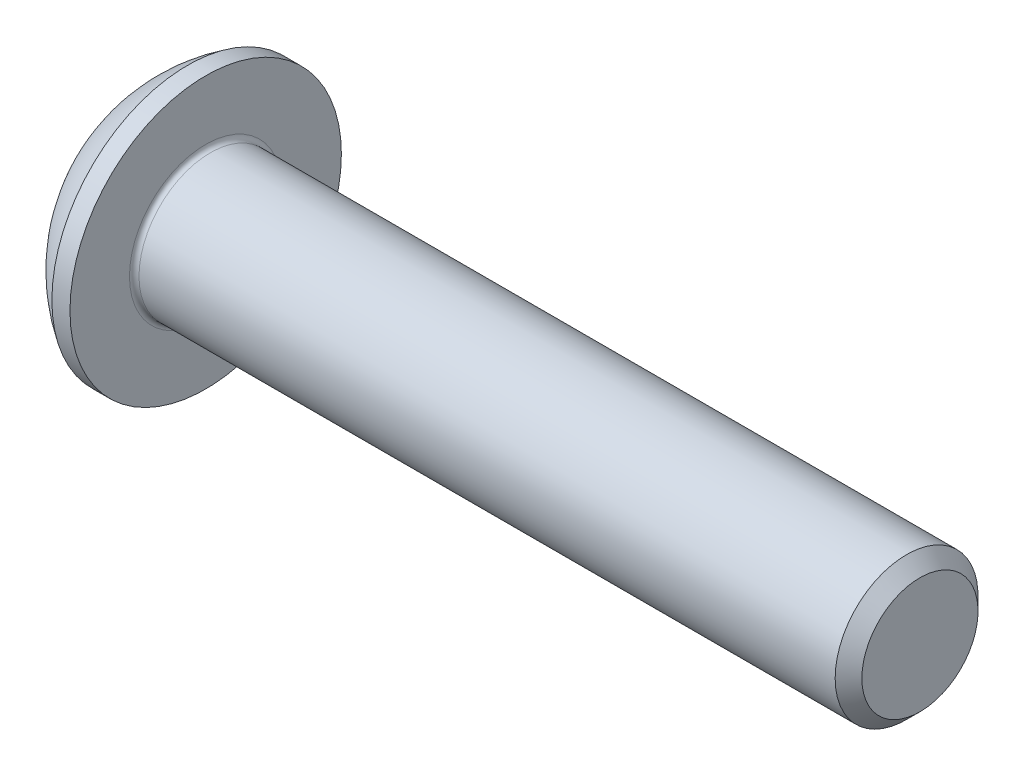
ISO-10303-21;
HEADER;
FILE_DESCRIPTION(('STEP AP214'),'2;1');
FILE_NAME('part.step','',(''),(''),'','','');
FILE_SCHEMA(('AUTOMOTIVE_DESIGN { 1 0 10303 214 1 1 1 1 }'));
ENDSEC;
DATA;
#1=APPLICATION_CONTEXT('core data for automotive mechanical design processes');
#2=APPLICATION_PROTOCOL_DEFINITION('international standard','automotive_design',2000,#1);
#3=PRODUCT_CONTEXT('',#1,'mechanical');
#4=PRODUCT('Part','Part','',(#3));
#5=PRODUCT_RELATED_PRODUCT_CATEGORY('part','',(#4));
#6=PRODUCT_DEFINITION_FORMATION('','',#4);
#7=PRODUCT_DEFINITION_CONTEXT('part definition',#1,'design');
#8=PRODUCT_DEFINITION('design','',#6,#7);
#9=PRODUCT_DEFINITION_SHAPE('','',#8);
#10=(LENGTH_UNIT() NAMED_UNIT(*) SI_UNIT(.MILLI.,.METRE.));
#11=(NAMED_UNIT(*) PLANE_ANGLE_UNIT() SI_UNIT($,.RADIAN.));
#12=(NAMED_UNIT(*) SI_UNIT($,.STERADIAN.) SOLID_ANGLE_UNIT());
#13=UNCERTAINTY_MEASURE_WITH_UNIT(LENGTH_MEASURE(1.E-05),#10,'distance_accuracy_value','');
#14=(GEOMETRIC_REPRESENTATION_CONTEXT(3) GLOBAL_UNCERTAINTY_ASSIGNED_CONTEXT((#13)) GLOBAL_UNIT_ASSIGNED_CONTEXT((#10,
#11,#12)) REPRESENTATION_CONTEXT('',''));
#15=CARTESIAN_POINT('',(0.,0.,0.));
#16=DIRECTION('',(0.,0.,1.));
#17=DIRECTION('',(1.,0.,0.));
#18=AXIS2_PLACEMENT_3D('',#15,#16,#17);
#19=CARTESIAN_POINT('',(0.,0.,0.));
#20=DIRECTION('',(-1.,0.,0.));
#21=DIRECTION('',(0.,0.,1.));
#22=AXIS2_PLACEMENT_3D('',#19,#20,#21);
#23=PLANE('',#22);
#24=CARTESIAN_POINT('',(0.,0.,0.));
#25=DIRECTION('',(-1.,0.,0.));
#26=DIRECTION('',(0.,0.,1.));
#27=AXIS2_PLACEMENT_3D('',#24,#25,#26);
#28=CIRCLE('',#27,1.425);
#29=CARTESIAN_POINT('',(0.,0.,1.425));
#30=VERTEX_POINT('',#29);
#31=EDGE_CURVE('E155',#30,#30,#28,.T.);
#32=ORIENTED_EDGE('',*,*,#31,.T.);
#33=EDGE_LOOP('',(#32));
#34=FACE_BOUND('',#33,.T.);
#35=DIRECTION('',(0.,-1.,0.));
#36=VECTOR('',#35,1.);
#37=CARTESIAN_POINT('',(0.,-0.577350269189625,0.999999999999998));
#38=LINE('',#37,#36);
#39=CARTESIAN_POINT('',(0.,0.577350269189628,1.));
#40=VERTEX_POINT('',#39);
#41=CARTESIAN_POINT('',(0.,-0.577350269189625,0.999999999999998));
#42=VERTEX_POINT('',#41);
#43=EDGE_CURVE('E50',#40,#42,#38,.T.);
#44=ORIENTED_EDGE('',*,*,#43,.T.);
#45=DIRECTION('',(0.,-0.499999999999999,-0.866025403784439));
#46=VECTOR('',#45,1.);
#47=CARTESIAN_POINT('',(0.,-1.15470053837925,0.));
#48=LINE('',#47,#46);
#49=CARTESIAN_POINT('',(0.,-1.15470053837925,0.));
#50=VERTEX_POINT('',#49);
#51=EDGE_CURVE('E275',#42,#50,#48,.T.);
#52=ORIENTED_EDGE('',*,*,#51,.T.);
#53=DIRECTION('',(0.,0.499999999999997,-0.86602540378444));
#54=VECTOR('',#53,1.);
#55=CARTESIAN_POINT('',(0.,-0.577350269189626,-1.));
#56=LINE('',#55,#54);
#57=CARTESIAN_POINT('',(0.,-0.577350269189626,-1.));
#58=VERTEX_POINT('',#57);
#59=EDGE_CURVE('E130',#50,#58,#56,.T.);
#60=ORIENTED_EDGE('',*,*,#59,.T.);
#61=DIRECTION('',(0.,1.,0.));
#62=VECTOR('',#61,1.);
#63=CARTESIAN_POINT('',(0.,0.577350269189628,-1.));
#64=LINE('',#63,#62);
#65=CARTESIAN_POINT('',(0.,0.577350269189628,-1.));
#66=VERTEX_POINT('',#65);
#67=EDGE_CURVE('E278',#58,#66,#64,.T.);
#68=ORIENTED_EDGE('',*,*,#67,.T.);
#69=DIRECTION('',(0.,0.499999999999998,0.866025403784439));
#70=VECTOR('',#69,1.);
#71=CARTESIAN_POINT('',(0.,1.15470053837925,0.));
#72=LINE('',#71,#70);
#73=CARTESIAN_POINT('',(0.,1.15470053837925,0.));
#74=VERTEX_POINT('',#73);
#75=EDGE_CURVE('E280',#66,#74,#72,.T.);
#76=ORIENTED_EDGE('',*,*,#75,.T.);
#77=DIRECTION('',(0.,-0.499999999999998,0.866025403784439));
#78=VECTOR('',#77,1.);
#79=CARTESIAN_POINT('',(0.,0.577350269189628,1.));
#80=LINE('',#79,#78);
#81=EDGE_CURVE('E282',#74,#40,#80,.T.);
#82=ORIENTED_EDGE('',*,*,#81,.T.);
#83=EDGE_LOOP('',(#44,#52,#60,#68,#76,#82));
#84=FACE_BOUND('',#83,.T.);
#85=ADVANCED_FACE('F35',(#34,#84),#23,.T.);
#86=CARTESIAN_POINT('',(3.03337598425198,0.,0.));
#87=DIRECTION('',(-1.,0.,0.));
#88=DIRECTION('',(0.,1.,0.));
#89=AXIS2_PLACEMENT_3D('',#86,#87,#88);
#90=SPHERICAL_SURFACE('',#89,3.35141684393879);
#91=CARTESIAN_POINT('',(1.27,0.,0.));
#92=DIRECTION('',(-1.,0.,0.));
#93=DIRECTION('',(0.,0.,1.));
#94=AXIS2_PLACEMENT_3D('',#91,#92,#93);
#95=CIRCLE('',#94,2.85);
#96=CARTESIAN_POINT('',(1.27,0.,2.85));
#97=VERTEX_POINT('',#96);
#98=EDGE_CURVE('E152',#97,#97,#95,.T.);
#99=ORIENTED_EDGE('',*,*,#98,.T.);
#100=EDGE_LOOP('',(#99));
#101=FACE_BOUND('',#100,.T.);
#102=ORIENTED_EDGE('',*,*,#31,.F.);
#103=EDGE_LOOP('',(#102));
#104=FACE_BOUND('',#103,.T.);
#105=ADVANCED_FACE('F176',(#101,#104),#90,.T.);
#106=CARTESIAN_POINT('',(0.,0.,0.));
#107=DIRECTION('',(-1.,0.,0.));
#108=DIRECTION('',(0.,0.,1.));
#109=AXIS2_PLACEMENT_3D('',#106,#107,#108);
#110=CYLINDRICAL_SURFACE('',#109,2.85);
#111=ORIENTED_EDGE('',*,*,#98,.F.);
#112=EDGE_LOOP('',(#111));
#113=FACE_BOUND('',#112,.T.);
#114=CARTESIAN_POINT('',(1.65,0.,0.));
#115=DIRECTION('',(-1.,0.,0.));
#116=DIRECTION('',(0.,0.,1.));
#117=AXIS2_PLACEMENT_3D('',#114,#115,#116);
#118=CIRCLE('',#117,2.85);
#119=CARTESIAN_POINT('',(1.65,0.,2.85));
#120=VERTEX_POINT('',#119);
#121=EDGE_CURVE('E149',#120,#120,#118,.T.);
#122=ORIENTED_EDGE('',*,*,#121,.T.);
#123=EDGE_LOOP('',(#122));
#124=FACE_BOUND('',#123,.T.);
#125=ADVANCED_FACE('F181',(#113,#124),#110,.T.);
#126=CARTESIAN_POINT('',(1.65,1.49999999999999,0.));
#127=DIRECTION('',(-1.,0.,0.));
#128=DIRECTION('',(0.,0.,1.));
#129=AXIS2_PLACEMENT_3D('',#126,#127,#128);
#130=PLANE('',#129);
#131=CARTESIAN_POINT('',(1.65,0.,0.));
#132=DIRECTION('',(-1.,0.,0.));
#133=DIRECTION('',(0.,0.,1.));
#134=AXIS2_PLACEMENT_3D('',#131,#132,#133);
#135=CIRCLE('',#134,1.6);
#136=CARTESIAN_POINT('',(1.65,0.,1.6));
#137=VERTEX_POINT('',#136);
#138=EDGE_CURVE('E43',#137,#137,#135,.T.);
#139=ORIENTED_EDGE('',*,*,#138,.T.);
#140=EDGE_LOOP('',(#139));
#141=FACE_BOUND('',#140,.T.);
#142=ORIENTED_EDGE('',*,*,#121,.F.);
#143=EDGE_LOOP('',(#142));
#144=FACE_BOUND('',#143,.T.);
#145=ADVANCED_FACE('F160',(#141,#144),#130,.F.);
#146=CARTESIAN_POINT('',(0.,0.,0.));
#147=DIRECTION('',(-1.,0.,0.));
#148=DIRECTION('',(0.,0.,1.));
#149=AXIS2_PLACEMENT_3D('',#146,#147,#148);
#150=CYLINDRICAL_SURFACE('',#149,1.5);
#151=CARTESIAN_POINT('',(1.75,0.,0.));
#152=DIRECTION('',(-1.,0.,0.));
#153=DIRECTION('',(0.,0.,1.));
#154=AXIS2_PLACEMENT_3D('',#151,#152,#153);
#155=CIRCLE('',#154,1.5);
#156=CARTESIAN_POINT('',(1.75,0.,1.5));
#157=VERTEX_POINT('',#156);
#158=EDGE_CURVE('E11',#157,#157,#155,.F.);
#159=ORIENTED_EDGE('',*,*,#158,.T.);
#160=EDGE_LOOP('',(#159));
#161=FACE_BOUND('',#160,.T.);
#162=CARTESIAN_POINT('',(16.3695,0.,0.));
#163=DIRECTION('',(-1.,0.,0.));
#164=DIRECTION('',(0.,0.,1.));
#165=AXIS2_PLACEMENT_3D('',#162,#163,#164);
#166=CIRCLE('',#165,1.5);
#167=CARTESIAN_POINT('',(16.3695,0.,1.5));
#168=VERTEX_POINT('',#167);
#169=EDGE_CURVE('E146',#168,#168,#166,.T.);
#170=ORIENTED_EDGE('',*,*,#169,.T.);
#171=EDGE_LOOP('',(#170));
#172=FACE_BOUND('',#171,.T.);
#173=ADVANCED_FACE('F190',(#161,#172),#150,.T.);
#174=CARTESIAN_POINT('',(16.65,0.,0.));
#175=DIRECTION('',(-1.,0.,0.));
#176=DIRECTION('',(0.,0.,1.));
#177=AXIS2_PLACEMENT_3D('',#174,#175,#176);
#178=CONICAL_SURFACE('',#177,1.2195,0.785398163397454);
#179=ORIENTED_EDGE('',*,*,#169,.F.);
#180=EDGE_LOOP('',(#179));
#181=FACE_BOUND('',#180,.T.);
#182=CARTESIAN_POINT('',(16.65,0.,0.));
#183=DIRECTION('',(-1.,0.,0.));
#184=DIRECTION('',(0.,0.,1.));
#185=AXIS2_PLACEMENT_3D('',#182,#183,#184);
#186=CIRCLE('',#185,1.2195);
#187=CARTESIAN_POINT('',(16.65,0.,1.2195));
#188=VERTEX_POINT('',#187);
#189=EDGE_CURVE('E142',#188,#188,#186,.T.);
#190=ORIENTED_EDGE('',*,*,#189,.T.);
#191=EDGE_LOOP('',(#190));
#192=FACE_BOUND('',#191,.T.);
#193=ADVANCED_FACE('F171',(#181,#192),#178,.T.);
#194=CARTESIAN_POINT('',(16.65,0.,0.));
#195=DIRECTION('',(-1.,0.,0.));
#196=DIRECTION('',(0.,0.,1.));
#197=AXIS2_PLACEMENT_3D('',#194,#195,#196);
#198=PLANE('',#197);
#199=ORIENTED_EDGE('',*,*,#189,.F.);
#200=EDGE_LOOP('',(#199));
#201=FACE_BOUND('',#200,.T.);
#202=ADVANCED_FACE('F164',(#201),#198,.F.);
#203=CARTESIAN_POINT('',(1.75,0.,0.));
#204=DIRECTION('',(-1.,0.,0.));
#205=DIRECTION('',(0.,0.,1.));
#206=AXIS2_PLACEMENT_3D('',#203,#204,#205);
#207=TOROIDAL_SURFACE('',#206,1.6,0.1);
#208=ORIENTED_EDGE('',*,*,#158,.F.);
#209=EDGE_LOOP('',(#208));
#210=FACE_BOUND('',#209,.T.);
#211=ORIENTED_EDGE('',*,*,#138,.F.);
#212=EDGE_LOOP('',(#211));
#213=FACE_BOUND('',#212,.T.);
#214=ADVANCED_FACE('F37',(#210,#213),#207,.F.);
#215=CARTESIAN_POINT('',(1.04,-1.15470053837925,0.));
#216=DIRECTION('',(0.,0.866025403784439,-0.499999999999999));
#217=DIRECTION('',(0.,0.499999999999999,0.866025403784439));
#218=AXIS2_PLACEMENT_3D('',#215,#216,#217);
#219=PLANE('',#218);
#220=DIRECTION('',(0.,-0.499999999999999,-0.866025403784439));
#221=VECTOR('',#220,1.);
#222=CARTESIAN_POINT('',(1.04,-1.15470053837925,0.));
#223=LINE('',#222,#221);
#224=CARTESIAN_POINT('',(1.04,-0.577350269189625,0.999999999999998));
#225=VERTEX_POINT('',#224);
#226=CARTESIAN_POINT('',(1.04,-0.866025403784437,0.499999999999998));
#227=VERTEX_POINT('',#226);
#228=EDGE_CURVE('E116',#225,#227,#223,.T.);
#229=ORIENTED_EDGE('',*,*,#228,.T.);
#230=CARTESIAN_POINT('',(1.04,-1.15470053837925,0.));
#231=VERTEX_POINT('',#230);
#232=EDGE_CURVE('E111',#227,#231,#223,.T.);
#233=ORIENTED_EDGE('',*,*,#232,.T.);
#234=DIRECTION('',(-1.,0.,0.));
#235=VECTOR('',#234,1.);
#236=CARTESIAN_POINT('',(1.04,-1.15470053837925,0.));
#237=LINE('',#236,#235);
#238=EDGE_CURVE('E113',#231,#50,#237,.T.);
#239=ORIENTED_EDGE('',*,*,#238,.T.);
#240=ORIENTED_EDGE('',*,*,#51,.F.);
#241=DIRECTION('',(-1.,0.,0.));
#242=VECTOR('',#241,1.);
#243=CARTESIAN_POINT('',(1.04,-0.577350269189625,0.999999999999998));
#244=LINE('',#243,#242);
#245=EDGE_CURVE('E271',#225,#42,#244,.T.);
#246=ORIENTED_EDGE('',*,*,#245,.F.);
#247=EDGE_LOOP('',(#229,#233,#239,#240,#246));
#248=FACE_BOUND('',#247,.T.);
#249=ADVANCED_FACE('F112',(#248),#219,.T.);
#250=CARTESIAN_POINT('',(1.04,-0.577350269189626,-1.));
#251=DIRECTION('',(0.,0.86602540378444,0.499999999999998));
#252=DIRECTION('',(0.,-0.499999999999998,0.86602540378444));
#253=AXIS2_PLACEMENT_3D('',#250,#251,#252);
#254=PLANE('',#253);
#255=DIRECTION('',(0.,0.499999999999997,-0.86602540378444));
#256=VECTOR('',#255,1.);
#257=CARTESIAN_POINT('',(1.04,-0.577350269189626,-1.));
#258=LINE('',#257,#256);
#259=CARTESIAN_POINT('',(1.04,-0.86602540378444,-0.499999999999997));
#260=VERTEX_POINT('',#259);
#261=EDGE_CURVE('E58',#231,#260,#258,.T.);
#262=ORIENTED_EDGE('',*,*,#261,.T.);
#263=CARTESIAN_POINT('',(1.04,-0.577350269189626,-1.));
#264=VERTEX_POINT('',#263);
#265=EDGE_CURVE('E125',#260,#264,#258,.T.);
#266=ORIENTED_EDGE('',*,*,#265,.T.);
#267=DIRECTION('',(-1.,0.,0.));
#268=VECTOR('',#267,1.);
#269=CARTESIAN_POINT('',(1.04,-0.577350269189626,-1.));
#270=LINE('',#269,#268);
#271=EDGE_CURVE('E132',#264,#58,#270,.T.);
#272=ORIENTED_EDGE('',*,*,#271,.T.);
#273=ORIENTED_EDGE('',*,*,#59,.F.);
#274=ORIENTED_EDGE('',*,*,#238,.F.);
#275=EDGE_LOOP('',(#262,#266,#272,#273,#274));
#276=FACE_BOUND('',#275,.T.);
#277=ADVANCED_FACE('F128',(#276),#254,.T.);
#278=CARTESIAN_POINT('',(1.04,0.577350269189628,-1.));
#279=DIRECTION('',(0.,0.,1.));
#280=DIRECTION('',(0.,-1.,0.));
#281=AXIS2_PLACEMENT_3D('',#278,#279,#280);
#282=PLANE('',#281);
#283=DIRECTION('',(0.,1.,0.));
#284=VECTOR('',#283,1.);
#285=CARTESIAN_POINT('',(1.04,0.577350269189628,-1.));
#286=LINE('',#285,#284);
#287=CARTESIAN_POINT('',(1.04,0.,-1.));
#288=VERTEX_POINT('',#287);
#289=EDGE_CURVE('E252',#264,#288,#286,.T.);
#290=ORIENTED_EDGE('',*,*,#289,.T.);
#291=CARTESIAN_POINT('',(1.04,0.577350269189628,-1.));
#292=VERTEX_POINT('',#291);
#293=EDGE_CURVE('E124',#288,#292,#286,.T.);
#294=ORIENTED_EDGE('',*,*,#293,.T.);
#295=DIRECTION('',(-1.,0.,0.));
#296=VECTOR('',#295,1.);
#297=CARTESIAN_POINT('',(1.04,0.577350269189628,-1.));
#298=LINE('',#297,#296);
#299=EDGE_CURVE('E137',#292,#66,#298,.T.);
#300=ORIENTED_EDGE('',*,*,#299,.T.);
#301=ORIENTED_EDGE('',*,*,#67,.F.);
#302=ORIENTED_EDGE('',*,*,#271,.F.);
#303=EDGE_LOOP('',(#290,#294,#300,#301,#302));
#304=FACE_BOUND('',#303,.T.);
#305=ADVANCED_FACE('F204',(#304),#282,.T.);
#306=CARTESIAN_POINT('',(1.04,1.15470053837925,0.));
#307=DIRECTION('',(0.,-0.86602540378444,0.499999999999998));
#308=DIRECTION('',(0.,-0.499999999999998,-0.86602540378444));
#309=AXIS2_PLACEMENT_3D('',#306,#307,#308);
#310=PLANE('',#309);
#311=DIRECTION('',(0.,0.499999999999998,0.866025403784439));
#312=VECTOR('',#311,1.);
#313=CARTESIAN_POINT('',(1.04,1.15470053837925,0.));
#314=LINE('',#313,#312);
#315=CARTESIAN_POINT('',(1.04,0.86602540378444,-0.499999999999999));
#316=VERTEX_POINT('',#315);
#317=EDGE_CURVE('E241',#292,#316,#314,.T.);
#318=ORIENTED_EDGE('',*,*,#317,.T.);
#319=CARTESIAN_POINT('',(1.04,1.15470053837925,0.));
#320=VERTEX_POINT('',#319);
#321=EDGE_CURVE('E246',#316,#320,#314,.T.);
#322=ORIENTED_EDGE('',*,*,#321,.T.);
#323=DIRECTION('',(-1.,0.,0.));
#324=VECTOR('',#323,1.);
#325=CARTESIAN_POINT('',(1.04,1.15470053837925,0.));
#326=LINE('',#325,#324);
#327=EDGE_CURVE('E286',#320,#74,#326,.T.);
#328=ORIENTED_EDGE('',*,*,#327,.T.);
#329=ORIENTED_EDGE('',*,*,#75,.F.);
#330=ORIENTED_EDGE('',*,*,#299,.F.);
#331=EDGE_LOOP('',(#318,#322,#328,#329,#330));
#332=FACE_BOUND('',#331,.T.);
#333=ADVANCED_FACE('F207',(#332),#310,.T.);
#334=CARTESIAN_POINT('',(1.04,0.577350269189628,1.));
#335=DIRECTION('',(0.,-0.86602540378444,-0.499999999999998));
#336=DIRECTION('',(0.,0.499999999999998,-0.86602540378444));
#337=AXIS2_PLACEMENT_3D('',#334,#335,#336);
#338=PLANE('',#337);
#339=DIRECTION('',(0.,-0.499999999999998,0.866025403784439));
#340=VECTOR('',#339,1.);
#341=CARTESIAN_POINT('',(1.04,0.577350269189628,1.));
#342=LINE('',#341,#340);
#343=CARTESIAN_POINT('',(1.04,0.86602540378444,0.499999999999999));
#344=VERTEX_POINT('',#343);
#345=EDGE_CURVE('E249',#320,#344,#342,.T.);
#346=ORIENTED_EDGE('',*,*,#345,.T.);
#347=CARTESIAN_POINT('',(1.04,0.577350269189628,1.));
#348=VERTEX_POINT('',#347);
#349=EDGE_CURVE('E257',#344,#348,#342,.T.);
#350=ORIENTED_EDGE('',*,*,#349,.T.);
#351=DIRECTION('',(-1.,0.,0.));
#352=VECTOR('',#351,1.);
#353=CARTESIAN_POINT('',(1.04,0.577350269189628,1.));
#354=LINE('',#353,#352);
#355=EDGE_CURVE('E270',#348,#40,#354,.T.);
#356=ORIENTED_EDGE('',*,*,#355,.T.);
#357=ORIENTED_EDGE('',*,*,#81,.F.);
#358=ORIENTED_EDGE('',*,*,#327,.F.);
#359=EDGE_LOOP('',(#346,#350,#356,#357,#358));
#360=FACE_BOUND('',#359,.T.);
#361=ADVANCED_FACE('F211',(#360),#338,.T.);
#362=CARTESIAN_POINT('',(1.04,-0.577350269189625,0.999999999999998));
#363=DIRECTION('',(0.,0.,-1.));
#364=DIRECTION('',(0.,1.,0.));
#365=AXIS2_PLACEMENT_3D('',#362,#363,#364);
#366=PLANE('',#365);
#367=DIRECTION('',(0.,-1.,0.));
#368=VECTOR('',#367,1.);
#369=CARTESIAN_POINT('',(1.04,-0.577350269189625,0.999999999999998));
#370=LINE('',#369,#368);
#371=CARTESIAN_POINT('',(1.04,0.,1.));
#372=VERTEX_POINT('',#371);
#373=EDGE_CURVE('E263',#348,#372,#370,.T.);
#374=ORIENTED_EDGE('',*,*,#373,.T.);
#375=EDGE_CURVE('E265',#372,#225,#370,.T.);
#376=ORIENTED_EDGE('',*,*,#375,.T.);
#377=ORIENTED_EDGE('',*,*,#245,.T.);
#378=ORIENTED_EDGE('',*,*,#43,.F.);
#379=ORIENTED_EDGE('',*,*,#355,.F.);
#380=EDGE_LOOP('',(#374,#376,#377,#378,#379));
#381=FACE_BOUND('',#380,.T.);
#382=ADVANCED_FACE('F215',(#381),#366,.T.);
#383=CARTESIAN_POINT('',(1.04,-1.73205080756887,-0.999999999999999));
#384=DIRECTION('',(1.,0.,0.));
#385=DIRECTION('',(0.,0.,-1.));
#386=AXIS2_PLACEMENT_3D('',#383,#384,#385);
#387=PLANE('',#386);
#388=CARTESIAN_POINT('',(1.04,0.,0.));
#389=DIRECTION('',(-1.,0.,0.));
#390=DIRECTION('',(0.,0.,1.));
#391=AXIS2_PLACEMENT_3D('',#388,#389,#390);
#392=CIRCLE('',#391,1.);
#393=EDGE_CURVE('E238',#316,#288,#392,.T.);
#394=ORIENTED_EDGE('',*,*,#393,.F.);
#395=ORIENTED_EDGE('',*,*,#317,.F.);
#396=ORIENTED_EDGE('',*,*,#293,.F.);
#397=EDGE_LOOP('',(#394,#395,#396));
#398=FACE_BOUND('',#397,.T.);
#399=ADVANCED_FACE('F219',(#398),#387,.F.);
#400=EDGE_CURVE('E143',#344,#316,#392,.T.);
#401=ORIENTED_EDGE('',*,*,#400,.F.);
#402=ORIENTED_EDGE('',*,*,#345,.F.);
#403=ORIENTED_EDGE('',*,*,#321,.F.);
#404=EDGE_LOOP('',(#401,#402,#403));
#405=FACE_BOUND('',#404,.T.);
#406=ADVANCED_FACE('F228',(#405),#387,.F.);
#407=EDGE_CURVE('E136',#372,#344,#392,.T.);
#408=ORIENTED_EDGE('',*,*,#407,.F.);
#409=ORIENTED_EDGE('',*,*,#373,.F.);
#410=ORIENTED_EDGE('',*,*,#349,.F.);
#411=EDGE_LOOP('',(#408,#409,#410));
#412=FACE_BOUND('',#411,.T.);
#413=ADVANCED_FACE('F233',(#412),#387,.F.);
#414=EDGE_CURVE('E131',#227,#372,#392,.T.);
#415=ORIENTED_EDGE('',*,*,#414,.F.);
#416=ORIENTED_EDGE('',*,*,#228,.F.);
#417=ORIENTED_EDGE('',*,*,#375,.F.);
#418=EDGE_LOOP('',(#415,#416,#417));
#419=FACE_BOUND('',#418,.T.);
#420=ADVANCED_FACE('F226',(#419),#387,.F.);
#421=EDGE_CURVE('E122',#260,#227,#392,.T.);
#422=ORIENTED_EDGE('',*,*,#421,.F.);
#423=ORIENTED_EDGE('',*,*,#261,.F.);
#424=ORIENTED_EDGE('',*,*,#232,.F.);
#425=EDGE_LOOP('',(#422,#423,#424));
#426=FACE_BOUND('',#425,.T.);
#427=ADVANCED_FACE('F121',(#426),#387,.F.);
#428=EDGE_CURVE('E244',#288,#260,#392,.T.);
#429=ORIENTED_EDGE('',*,*,#428,.F.);
#430=ORIENTED_EDGE('',*,*,#289,.F.);
#431=ORIENTED_EDGE('',*,*,#265,.F.);
#432=EDGE_LOOP('',(#429,#430,#431));
#433=FACE_BOUND('',#432,.T.);
#434=ADVANCED_FACE('F199',(#433),#387,.F.);
#435=CARTESIAN_POINT('',(1.61735026918963,0.,0.));
#436=DIRECTION('',(-1.,0.,0.));
#437=DIRECTION('',(0.,0.,1.));
#438=AXIS2_PLACEMENT_3D('',#435,#436,#437);
#439=CONICAL_SURFACE('',#438,0.,1.04719755119659);
#440=ORIENTED_EDGE('',*,*,#407,.T.);
#441=ORIENTED_EDGE('',*,*,#400,.T.);
#442=ORIENTED_EDGE('',*,*,#393,.T.);
#443=ORIENTED_EDGE('',*,*,#428,.T.);
#444=ORIENTED_EDGE('',*,*,#421,.T.);
#445=ORIENTED_EDGE('',*,*,#414,.T.);
#446=EDGE_LOOP('',(#440,#441,#442,#443,#444,#445));
#447=FACE_BOUND('',#446,.T.);
#448=CARTESIAN_POINT('',(1.61735026918963,0.,0.));
#449=VERTEX_POINT('',#448);
#450=VERTEX_LOOP('',#449);
#451=FACE_BOUND('',#450,.T.);
#452=ADVANCED_FACE('F197',(#447,#451),#439,.F.);
#453=CLOSED_SHELL('',(#85,#105,#125,#145,#173,#193,#202,#214,#249,#277,#305,#333,#361,#382,#399,
#406,#413,#420,#427,#434,#452));
#454=MANIFOLD_SOLID_BREP('B2',#453);
#455=ADVANCED_BREP_SHAPE_REPRESENTATION('',(#18,#454),#14);
#456=SHAPE_DEFINITION_REPRESENTATION(#9,#455);
ENDSEC;
END-ISO-10303-21;
